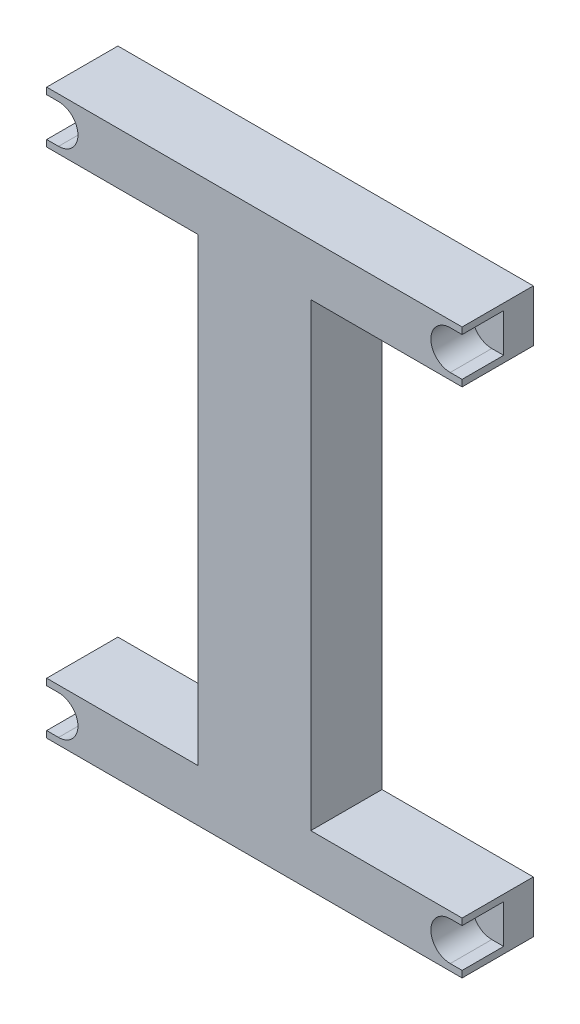
ISO-10303-21;
HEADER;
FILE_DESCRIPTION(('STEP AP214'),'2;1');
FILE_NAME('part.step','',(''),(''),'','','');
FILE_SCHEMA(('AUTOMOTIVE_DESIGN { 1 0 10303 214 1 1 1 1 }'));
ENDSEC;
DATA;
#1=APPLICATION_CONTEXT('core data for automotive mechanical design processes');
#2=APPLICATION_PROTOCOL_DEFINITION('international standard','automotive_design',2000,#1);
#3=PRODUCT_CONTEXT('',#1,'mechanical');
#4=PRODUCT('Part','Part','',(#3));
#5=PRODUCT_RELATED_PRODUCT_CATEGORY('part','',(#4));
#6=PRODUCT_DEFINITION_FORMATION('','',#4);
#7=PRODUCT_DEFINITION_CONTEXT('part definition',#1,'design');
#8=PRODUCT_DEFINITION('design','',#6,#7);
#9=PRODUCT_DEFINITION_SHAPE('','',#8);
#10=(LENGTH_UNIT() NAMED_UNIT(*) SI_UNIT(.MILLI.,.METRE.));
#11=(NAMED_UNIT(*) PLANE_ANGLE_UNIT() SI_UNIT($,.RADIAN.));
#12=(NAMED_UNIT(*) SI_UNIT($,.STERADIAN.) SOLID_ANGLE_UNIT());
#13=UNCERTAINTY_MEASURE_WITH_UNIT(LENGTH_MEASURE(1.E-05),#10,'distance_accuracy_value','');
#14=(GEOMETRIC_REPRESENTATION_CONTEXT(3) GLOBAL_UNCERTAINTY_ASSIGNED_CONTEXT((#13)) GLOBAL_UNIT_ASSIGNED_CONTEXT((#10,
#11,#12)) REPRESENTATION_CONTEXT('',''));
#15=CARTESIAN_POINT('',(0.,0.,0.));
#16=DIRECTION('',(0.,0.,1.));
#17=DIRECTION('',(1.,0.,0.));
#18=AXIS2_PLACEMENT_3D('',#15,#16,#17);
#19=CARTESIAN_POINT('',(0.,0.,24.));
#20=DIRECTION('',(0.,0.,1.));
#21=DIRECTION('',(1.,0.,0.));
#22=AXIS2_PLACEMENT_3D('',#19,#20,#21);
#23=PLANE('',#22);
#24=DIRECTION('',(1.,0.,0.));
#25=VECTOR('',#24,1.);
#26=CARTESIAN_POINT('',(70.,79.7188434375751,24.));
#27=LINE('',#26,#25);
#28=CARTESIAN_POINT('',(66.,79.7188434375752,24.));
#29=VERTEX_POINT('',#28);
#30=CARTESIAN_POINT('',(70.,79.7188434375751,24.));
#31=VERTEX_POINT('',#30);
#32=EDGE_CURVE('E232',#29,#31,#27,.T.);
#33=ORIENTED_EDGE('',*,*,#32,.F.);
#34=CARTESIAN_POINT('',(66.,86.25,24.));
#35=DIRECTION('',(0.,0.,1.));
#36=DIRECTION('',(-1.,0.,0.));
#37=AXIS2_PLACEMENT_3D('',#34,#35,#36);
#38=CIRCLE('',#37,6.53115656242485);
#39=CARTESIAN_POINT('',(66.,92.7811565624249,24.));
#40=VERTEX_POINT('',#39);
#41=EDGE_CURVE('E775',#40,#29,#38,.T.);
#42=ORIENTED_EDGE('',*,*,#41,.F.);
#43=DIRECTION('',(-1.,0.,0.));
#44=VECTOR('',#43,1.);
#45=CARTESIAN_POINT('',(70.,92.781156562425,24.));
#46=LINE('',#45,#44);
#47=CARTESIAN_POINT('',(70.,92.781156562425,24.));
#48=VERTEX_POINT('',#47);
#49=EDGE_CURVE('E265',#48,#40,#46,.T.);
#50=ORIENTED_EDGE('',*,*,#49,.F.);
#51=DIRECTION('',(0.,-1.,0.));
#52=VECTOR('',#51,1.);
#53=CARTESIAN_POINT('',(70.,0.,24.));
#54=LINE('',#53,#52);
#55=CARTESIAN_POINT('',(70.,95.,24.));
#56=VERTEX_POINT('',#55);
#57=EDGE_CURVE('E237',#56,#48,#54,.T.);
#58=ORIENTED_EDGE('',*,*,#57,.F.);
#59=DIRECTION('',(1.,0.,0.));
#60=VECTOR('',#59,1.);
#61=CARTESIAN_POINT('',(0.,95.,24.));
#62=LINE('',#61,#60);
#63=CARTESIAN_POINT('',(-70.,95.,24.));
#64=VERTEX_POINT('',#63);
#65=EDGE_CURVE('E377',#64,#56,#62,.T.);
#66=ORIENTED_EDGE('',*,*,#65,.F.);
#67=DIRECTION('',(0.,-1.,0.));
#68=VECTOR('',#67,1.);
#69=CARTESIAN_POINT('',(-70.,0.,24.));
#70=LINE('',#69,#68);
#71=CARTESIAN_POINT('',(-70.,92.7811565624249,24.));
#72=VERTEX_POINT('',#71);
#73=EDGE_CURVE('E383',#64,#72,#70,.T.);
#74=ORIENTED_EDGE('',*,*,#73,.T.);
#75=DIRECTION('',(-1.,0.,0.));
#76=VECTOR('',#75,1.);
#77=CARTESIAN_POINT('',(-70.,92.7811565624249,24.));
#78=LINE('',#77,#76);
#79=CARTESIAN_POINT('',(-66.,92.7811565624249,24.));
#80=VERTEX_POINT('',#79);
#81=EDGE_CURVE('E248',#80,#72,#78,.T.);
#82=ORIENTED_EDGE('',*,*,#81,.F.);
#83=CARTESIAN_POINT('',(-66.,86.25,24.));
#84=DIRECTION('',(0.,0.,1.));
#85=DIRECTION('',(1.,0.,0.));
#86=AXIS2_PLACEMENT_3D('',#83,#84,#85);
#87=CIRCLE('',#86,6.53115656242487);
#88=CARTESIAN_POINT('',(-66.,79.7188434375752,24.));
#89=VERTEX_POINT('',#88);
#90=EDGE_CURVE('E257',#89,#80,#87,.T.);
#91=ORIENTED_EDGE('',*,*,#90,.F.);
#92=DIRECTION('',(1.,0.,0.));
#93=VECTOR('',#92,1.);
#94=CARTESIAN_POINT('',(-70.,79.718843437575,24.));
#95=LINE('',#94,#93);
#96=CARTESIAN_POINT('',(-70.,79.718843437575,24.));
#97=VERTEX_POINT('',#96);
#98=EDGE_CURVE('E254',#97,#89,#95,.T.);
#99=ORIENTED_EDGE('',*,*,#98,.F.);
#100=CARTESIAN_POINT('',(-70.,77.5,24.));
#101=VERTEX_POINT('',#100);
#102=EDGE_CURVE('E387',#97,#101,#70,.T.);
#103=ORIENTED_EDGE('',*,*,#102,.T.);
#104=DIRECTION('',(1.,0.,0.));
#105=VECTOR('',#104,1.);
#106=CARTESIAN_POINT('',(0.,77.5,24.));
#107=LINE('',#106,#105);
#108=CARTESIAN_POINT('',(-19.,77.5,24.));
#109=VERTEX_POINT('',#108);
#110=EDGE_CURVE('E356',#101,#109,#107,.T.);
#111=ORIENTED_EDGE('',*,*,#110,.T.);
#112=DIRECTION('',(0.,-1.,0.));
#113=VECTOR('',#112,1.);
#114=CARTESIAN_POINT('',(-19.,0.,24.));
#115=LINE('',#114,#113);
#116=CARTESIAN_POINT('',(-19.,-77.5,24.));
#117=VERTEX_POINT('',#116);
#118=EDGE_CURVE('E339',#109,#117,#115,.T.);
#119=ORIENTED_EDGE('',*,*,#118,.T.);
#120=DIRECTION('',(-1.,0.,0.));
#121=VECTOR('',#120,1.);
#122=CARTESIAN_POINT('',(0.,-77.5,24.));
#123=LINE('',#122,#121);
#124=CARTESIAN_POINT('',(-70.,-77.5,24.));
#125=VERTEX_POINT('',#124);
#126=EDGE_CURVE('E349',#117,#125,#123,.T.);
#127=ORIENTED_EDGE('',*,*,#126,.T.);
#128=CARTESIAN_POINT('',(-70.,-79.7188434375751,24.));
#129=VERTEX_POINT('',#128);
#130=EDGE_CURVE('E388',#125,#129,#70,.T.);
#131=ORIENTED_EDGE('',*,*,#130,.T.);
#132=DIRECTION('',(-1.,0.,0.));
#133=VECTOR('',#132,1.);
#134=CARTESIAN_POINT('',(-70.,-79.7188434375751,24.));
#135=LINE('',#134,#133);
#136=CARTESIAN_POINT('',(-66.,-79.7188434375752,24.));
#137=VERTEX_POINT('',#136);
#138=EDGE_CURVE('E275',#137,#129,#135,.T.);
#139=ORIENTED_EDGE('',*,*,#138,.F.);
#140=CARTESIAN_POINT('',(-66.,-86.25,24.));
#141=DIRECTION('',(0.,0.,1.));
#142=DIRECTION('',(-1.,0.,0.));
#143=AXIS2_PLACEMENT_3D('',#140,#141,#142);
#144=CIRCLE('',#143,6.53115656242487);
#145=CARTESIAN_POINT('',(-66.,-92.7811565624249,24.));
#146=VERTEX_POINT('',#145);
#147=EDGE_CURVE('E282',#146,#137,#144,.T.);
#148=ORIENTED_EDGE('',*,*,#147,.F.);
#149=DIRECTION('',(1.,0.,0.));
#150=VECTOR('',#149,1.);
#151=CARTESIAN_POINT('',(-70.,-92.781156562425,24.));
#152=LINE('',#151,#150);
#153=CARTESIAN_POINT('',(-70.,-92.781156562425,24.));
#154=VERTEX_POINT('',#153);
#155=EDGE_CURVE('E279',#154,#146,#152,.T.);
#156=ORIENTED_EDGE('',*,*,#155,.F.);
#157=CARTESIAN_POINT('',(-70.,-95.,24.));
#158=VERTEX_POINT('',#157);
#159=EDGE_CURVE('E382',#154,#158,#70,.T.);
#160=ORIENTED_EDGE('',*,*,#159,.T.);
#161=DIRECTION('',(1.,0.,0.));
#162=VECTOR('',#161,1.);
#163=CARTESIAN_POINT('',(0.,-95.,24.));
#164=LINE('',#163,#162);
#165=CARTESIAN_POINT('',(70.,-95.0000000000001,24.));
#166=VERTEX_POINT('',#165);
#167=EDGE_CURVE('E371',#158,#166,#164,.T.);
#168=ORIENTED_EDGE('',*,*,#167,.T.);
#169=CARTESIAN_POINT('',(70.,-92.781156562425,24.));
#170=VERTEX_POINT('',#169);
#171=EDGE_CURVE('E374',#170,#166,#54,.T.);
#172=ORIENTED_EDGE('',*,*,#171,.F.);
#173=DIRECTION('',(1.,0.,0.));
#174=VECTOR('',#173,1.);
#175=CARTESIAN_POINT('',(70.,-92.781156562425,24.));
#176=LINE('',#175,#174);
#177=CARTESIAN_POINT('',(66.,-92.7811565624249,24.));
#178=VERTEX_POINT('',#177);
#179=EDGE_CURVE('E297',#178,#170,#176,.T.);
#180=ORIENTED_EDGE('',*,*,#179,.F.);
#181=CARTESIAN_POINT('',(66.,-86.25,24.));
#182=DIRECTION('',(0.,0.,1.));
#183=DIRECTION('',(1.,0.,0.));
#184=AXIS2_PLACEMENT_3D('',#181,#182,#183);
#185=CIRCLE('',#184,6.53115656242485);
#186=CARTESIAN_POINT('',(66.,-79.7188434375752,24.));
#187=VERTEX_POINT('',#186);
#188=EDGE_CURVE('E306',#187,#178,#185,.T.);
#189=ORIENTED_EDGE('',*,*,#188,.F.);
#190=DIRECTION('',(-1.,0.,0.));
#191=VECTOR('',#190,1.);
#192=CARTESIAN_POINT('',(70.,-79.7188434375751,24.));
#193=LINE('',#192,#191);
#194=CARTESIAN_POINT('',(70.,-79.7188434375751,24.));
#195=VERTEX_POINT('',#194);
#196=EDGE_CURVE('E303',#195,#187,#193,.T.);
#197=ORIENTED_EDGE('',*,*,#196,.F.);
#198=CARTESIAN_POINT('',(70.,-77.5,24.));
#199=VERTEX_POINT('',#198);
#200=EDGE_CURVE('E379',#199,#195,#54,.T.);
#201=ORIENTED_EDGE('',*,*,#200,.F.);
#202=DIRECTION('',(1.,0.,0.));
#203=VECTOR('',#202,1.);
#204=CARTESIAN_POINT('',(0.,-77.5,24.));
#205=LINE('',#204,#203);
#206=CARTESIAN_POINT('',(19.,-77.5,24.));
#207=VERTEX_POINT('',#206);
#208=EDGE_CURVE('E323',#207,#199,#205,.T.);
#209=ORIENTED_EDGE('',*,*,#208,.F.);
#210=DIRECTION('',(0.,-1.,0.));
#211=VECTOR('',#210,1.);
#212=CARTESIAN_POINT('',(19.,0.,24.));
#213=LINE('',#212,#211);
#214=CARTESIAN_POINT('',(19.,77.5,24.));
#215=VERTEX_POINT('',#214);
#216=EDGE_CURVE('E332',#215,#207,#213,.T.);
#217=ORIENTED_EDGE('',*,*,#216,.F.);
#218=DIRECTION('',(1.,0.,0.));
#219=VECTOR('',#218,1.);
#220=CARTESIAN_POINT('',(0.,77.5,24.));
#221=LINE('',#220,#219);
#222=CARTESIAN_POINT('',(70.,77.5,24.));
#223=VERTEX_POINT('',#222);
#224=EDGE_CURVE('E314',#215,#223,#221,.T.);
#225=ORIENTED_EDGE('',*,*,#224,.T.);
#226=EDGE_CURVE('E378',#31,#223,#54,.T.);
#227=ORIENTED_EDGE('',*,*,#226,.F.);
#228=EDGE_LOOP('',(#33,#42,#50,#58,#66,#74,#82,#91,#99,#103,#111,#119,#127,#131,#139,#148,#156,
#160,#168,#172,#180,#189,#197,#201,#209,#217,#225,#227));
#229=FACE_BOUND('',#228,.T.);
#230=ADVANCED_FACE('F33',(#229),#23,.T.);
#231=CARTESIAN_POINT('',(0.,0.,0.));
#232=DIRECTION('',(0.,0.,1.));
#233=DIRECTION('',(1.,0.,0.));
#234=AXIS2_PLACEMENT_3D('',#231,#232,#233);
#235=PLANE('',#234);
#236=DIRECTION('',(1.,0.,0.));
#237=VECTOR('',#236,1.);
#238=CARTESIAN_POINT('',(0.,77.5,0.));
#239=LINE('',#238,#237);
#240=CARTESIAN_POINT('',(19.,77.5,0.));
#241=VERTEX_POINT('',#240);
#242=CARTESIAN_POINT('',(70.,77.5,0.));
#243=VERTEX_POINT('',#242);
#244=EDGE_CURVE('E320',#241,#243,#239,.T.);
#245=ORIENTED_EDGE('',*,*,#244,.F.);
#246=DIRECTION('',(0.,-1.,0.));
#247=VECTOR('',#246,1.);
#248=CARTESIAN_POINT('',(19.,0.,0.));
#249=LINE('',#248,#247);
#250=CARTESIAN_POINT('',(19.,-77.5,0.));
#251=VERTEX_POINT('',#250);
#252=EDGE_CURVE('E322',#241,#251,#249,.T.);
#253=ORIENTED_EDGE('',*,*,#252,.T.);
#254=DIRECTION('',(1.,0.,0.));
#255=VECTOR('',#254,1.);
#256=CARTESIAN_POINT('',(0.,-77.5,0.));
#257=LINE('',#256,#255);
#258=CARTESIAN_POINT('',(70.,-77.5,0.));
#259=VERTEX_POINT('',#258);
#260=EDGE_CURVE('E326',#251,#259,#257,.T.);
#261=ORIENTED_EDGE('',*,*,#260,.T.);
#262=DIRECTION('',(0.,-1.,0.));
#263=VECTOR('',#262,1.);
#264=CARTESIAN_POINT('',(70.,0.,0.));
#265=LINE('',#264,#263);
#266=CARTESIAN_POINT('',(70.,-95.0000000000001,0.));
#267=VERTEX_POINT('',#266);
#268=EDGE_CURVE('E391',#259,#267,#265,.T.);
#269=ORIENTED_EDGE('',*,*,#268,.T.);
#270=DIRECTION('',(1.,0.,0.));
#271=VECTOR('',#270,1.);
#272=CARTESIAN_POINT('',(0.,-95.,0.));
#273=LINE('',#272,#271);
#274=CARTESIAN_POINT('',(-70.,-95.,0.));
#275=VERTEX_POINT('',#274);
#276=EDGE_CURVE('E364',#275,#267,#273,.T.);
#277=ORIENTED_EDGE('',*,*,#276,.F.);
#278=DIRECTION('',(0.,-1.,0.));
#279=VECTOR('',#278,1.);
#280=CARTESIAN_POINT('',(-70.,0.,0.));
#281=LINE('',#280,#279);
#282=CARTESIAN_POINT('',(-70.,-77.5,0.));
#283=VERTEX_POINT('',#282);
#284=EDGE_CURVE('E398',#283,#275,#281,.T.);
#285=ORIENTED_EDGE('',*,*,#284,.F.);
#286=DIRECTION('',(-1.,0.,0.));
#287=VECTOR('',#286,1.);
#288=CARTESIAN_POINT('',(0.,-77.5,0.));
#289=LINE('',#288,#287);
#290=CARTESIAN_POINT('',(-19.,-77.5,0.));
#291=VERTEX_POINT('',#290);
#292=EDGE_CURVE('E351',#291,#283,#289,.T.);
#293=ORIENTED_EDGE('',*,*,#292,.F.);
#294=DIRECTION('',(0.,-1.,0.));
#295=VECTOR('',#294,1.);
#296=CARTESIAN_POINT('',(-19.,0.,0.));
#297=LINE('',#296,#295);
#298=CARTESIAN_POINT('',(-19.,77.5,0.));
#299=VERTEX_POINT('',#298);
#300=EDGE_CURVE('E346',#299,#291,#297,.T.);
#301=ORIENTED_EDGE('',*,*,#300,.F.);
#302=DIRECTION('',(1.,0.,0.));
#303=VECTOR('',#302,1.);
#304=CARTESIAN_POINT('',(0.,77.5,0.));
#305=LINE('',#304,#303);
#306=CARTESIAN_POINT('',(-70.,77.5,0.));
#307=VERTEX_POINT('',#306);
#308=EDGE_CURVE('E348',#307,#299,#305,.T.);
#309=ORIENTED_EDGE('',*,*,#308,.F.);
#310=CARTESIAN_POINT('',(-70.,95.,0.));
#311=VERTEX_POINT('',#310);
#312=EDGE_CURVE('E375',#311,#307,#281,.T.);
#313=ORIENTED_EDGE('',*,*,#312,.F.);
#314=DIRECTION('',(1.,0.,0.));
#315=VECTOR('',#314,1.);
#316=CARTESIAN_POINT('',(0.,95.,0.));
#317=LINE('',#316,#315);
#318=CARTESIAN_POINT('',(70.,95.,0.));
#319=VERTEX_POINT('',#318);
#320=EDGE_CURVE('E395',#311,#319,#317,.T.);
#321=ORIENTED_EDGE('',*,*,#320,.T.);
#322=EDGE_CURVE('E392',#319,#243,#265,.T.);
#323=ORIENTED_EDGE('',*,*,#322,.T.);
#324=EDGE_LOOP('',(#245,#253,#261,#269,#277,#285,#293,#301,#309,#313,#321,#323));
#325=FACE_BOUND('',#324,.T.);
#326=ADVANCED_FACE('F464',(#325),#235,.F.);
#327=CARTESIAN_POINT('',(70.,0.,24.));
#328=DIRECTION('',(1.,0.,0.));
#329=DIRECTION('',(0.,1.,0.));
#330=AXIS2_PLACEMENT_3D('',#327,#328,#329);
#331=PLANE('',#330);
#332=DIRECTION('',(0.,0.,1.));
#333=VECTOR('',#332,1.);
#334=CARTESIAN_POINT('',(70.,79.7188434375751,10.));
#335=LINE('',#334,#333);
#336=CARTESIAN_POINT('',(70.,79.7188434375751,10.));
#337=VERTEX_POINT('',#336);
#338=EDGE_CURVE('E307',#337,#31,#335,.T.);
#339=ORIENTED_EDGE('',*,*,#338,.T.);
#340=ORIENTED_EDGE('',*,*,#226,.T.);
#341=DIRECTION('',(0.,0.,1.));
#342=VECTOR('',#341,1.);
#343=CARTESIAN_POINT('',(70.,77.5,0.));
#344=LINE('',#343,#342);
#345=EDGE_CURVE('E336',#243,#223,#344,.T.);
#346=ORIENTED_EDGE('',*,*,#345,.F.);
#347=ORIENTED_EDGE('',*,*,#322,.F.);
#348=DIRECTION('',(0.,0.,-1.));
#349=VECTOR('',#348,1.);
#350=CARTESIAN_POINT('',(70.,95.,24.));
#351=LINE('',#350,#349);
#352=EDGE_CURVE('E405',#56,#319,#351,.T.);
#353=ORIENTED_EDGE('',*,*,#352,.F.);
#354=ORIENTED_EDGE('',*,*,#57,.T.);
#355=DIRECTION('',(0.,0.,1.));
#356=VECTOR('',#355,1.);
#357=CARTESIAN_POINT('',(70.,92.781156562425,10.));
#358=LINE('',#357,#356);
#359=CARTESIAN_POINT('',(70.,92.781156562425,10.));
#360=VERTEX_POINT('',#359);
#361=EDGE_CURVE('E227',#360,#48,#358,.T.);
#362=ORIENTED_EDGE('',*,*,#361,.F.);
#363=DIRECTION('',(0.,1.,0.));
#364=VECTOR('',#363,1.);
#365=CARTESIAN_POINT('',(70.,0.,10.));
#366=LINE('',#365,#364);
#367=EDGE_CURVE('E11',#337,#360,#366,.T.);
#368=ORIENTED_EDGE('',*,*,#367,.F.);
#369=EDGE_LOOP('',(#339,#340,#346,#347,#353,#354,#362,#368));
#370=FACE_BOUND('',#369,.T.);
#371=ADVANCED_FACE('F235',(#370),#331,.T.);
#372=CARTESIAN_POINT('',(-70.,0.,24.));
#373=DIRECTION('',(1.,0.,0.));
#374=DIRECTION('',(0.,1.,0.));
#375=AXIS2_PLACEMENT_3D('',#372,#373,#374);
#376=PLANE('',#375);
#377=DIRECTION('',(0.,1.,0.));
#378=VECTOR('',#377,1.);
#379=CARTESIAN_POINT('',(-70.,0.,10.));
#380=LINE('',#379,#378);
#381=CARTESIAN_POINT('',(-70.,-92.781156562425,10.));
#382=VERTEX_POINT('',#381);
#383=CARTESIAN_POINT('',(-70.,-79.7188434375751,10.));
#384=VERTEX_POINT('',#383);
#385=EDGE_CURVE('E41',#382,#384,#380,.T.);
#386=ORIENTED_EDGE('',*,*,#385,.T.);
#387=DIRECTION('',(0.,0.,1.));
#388=VECTOR('',#387,1.);
#389=CARTESIAN_POINT('',(-70.,-79.7188434375751,10.));
#390=LINE('',#389,#388);
#391=EDGE_CURVE('E258',#384,#129,#390,.T.);
#392=ORIENTED_EDGE('',*,*,#391,.T.);
#393=ORIENTED_EDGE('',*,*,#130,.F.);
#394=DIRECTION('',(0.,0.,1.));
#395=VECTOR('',#394,1.);
#396=CARTESIAN_POINT('',(-70.,-77.5,0.));
#397=LINE('',#396,#395);
#398=EDGE_CURVE('E365',#283,#125,#397,.T.);
#399=ORIENTED_EDGE('',*,*,#398,.F.);
#400=ORIENTED_EDGE('',*,*,#284,.T.);
#401=DIRECTION('',(0.,0.,-1.));
#402=VECTOR('',#401,1.);
#403=CARTESIAN_POINT('',(-70.,-95.,24.));
#404=LINE('',#403,#402);
#405=EDGE_CURVE('E386',#158,#275,#404,.T.);
#406=ORIENTED_EDGE('',*,*,#405,.F.);
#407=ORIENTED_EDGE('',*,*,#159,.F.);
#408=DIRECTION('',(0.,0.,1.));
#409=VECTOR('',#408,1.);
#410=CARTESIAN_POINT('',(-70.,-92.781156562425,10.));
#411=LINE('',#410,#409);
#412=EDGE_CURVE('E278',#382,#154,#411,.T.);
#413=ORIENTED_EDGE('',*,*,#412,.F.);
#414=EDGE_LOOP('',(#386,#392,#393,#399,#400,#406,#407,#413));
#415=FACE_BOUND('',#414,.T.);
#416=ADVANCED_FACE('F417',(#415),#376,.F.);
#417=DIRECTION('',(0.,-1.,0.));
#418=VECTOR('',#417,1.);
#419=CARTESIAN_POINT('',(-70.,0.,10.));
#420=LINE('',#419,#418);
#421=CARTESIAN_POINT('',(-70.,92.7811565624249,10.));
#422=VERTEX_POINT('',#421);
#423=CARTESIAN_POINT('',(-70.,79.718843437575,10.));
#424=VERTEX_POINT('',#423);
#425=EDGE_CURVE('E413',#422,#424,#420,.T.);
#426=ORIENTED_EDGE('',*,*,#425,.F.);
#427=DIRECTION('',(0.,0.,1.));
#428=VECTOR('',#427,1.);
#429=CARTESIAN_POINT('',(-70.,92.7811565624249,10.));
#430=LINE('',#429,#428);
#431=EDGE_CURVE('E262',#422,#72,#430,.T.);
#432=ORIENTED_EDGE('',*,*,#431,.T.);
#433=ORIENTED_EDGE('',*,*,#73,.F.);
#434=DIRECTION('',(0.,0.,-1.));
#435=VECTOR('',#434,1.);
#436=CARTESIAN_POINT('',(-70.,95.,24.));
#437=LINE('',#436,#435);
#438=EDGE_CURVE('E403',#64,#311,#437,.T.);
#439=ORIENTED_EDGE('',*,*,#438,.T.);
#440=ORIENTED_EDGE('',*,*,#312,.T.);
#441=DIRECTION('',(0.,0.,1.));
#442=VECTOR('',#441,1.);
#443=CARTESIAN_POINT('',(-70.,77.5,0.));
#444=LINE('',#443,#442);
#445=EDGE_CURVE('E367',#307,#101,#444,.T.);
#446=ORIENTED_EDGE('',*,*,#445,.T.);
#447=ORIENTED_EDGE('',*,*,#102,.F.);
#448=DIRECTION('',(0.,0.,1.));
#449=VECTOR('',#448,1.);
#450=CARTESIAN_POINT('',(-70.,79.718843437575,10.));
#451=LINE('',#450,#449);
#452=EDGE_CURVE('E253',#424,#97,#451,.T.);
#453=ORIENTED_EDGE('',*,*,#452,.F.);
#454=EDGE_LOOP('',(#426,#432,#433,#439,#440,#446,#447,#453));
#455=FACE_BOUND('',#454,.T.);
#456=ADVANCED_FACE('F474',(#455),#376,.F.);
#457=CARTESIAN_POINT('',(0.,-95.,24.));
#458=DIRECTION('',(0.,1.,0.));
#459=DIRECTION('',(-1.,0.,0.));
#460=AXIS2_PLACEMENT_3D('',#457,#458,#459);
#461=PLANE('',#460);
#462=ORIENTED_EDGE('',*,*,#276,.T.);
#463=DIRECTION('',(0.,0.,-1.));
#464=VECTOR('',#463,1.);
#465=CARTESIAN_POINT('',(70.,-95.0000000000001,24.));
#466=LINE('',#465,#464);
#467=EDGE_CURVE('E407',#166,#267,#466,.T.);
#468=ORIENTED_EDGE('',*,*,#467,.F.);
#469=ORIENTED_EDGE('',*,*,#167,.F.);
#470=ORIENTED_EDGE('',*,*,#405,.T.);
#471=EDGE_LOOP('',(#462,#468,#469,#470));
#472=FACE_BOUND('',#471,.T.);
#473=ADVANCED_FACE('F35',(#472),#461,.F.);
#474=DIRECTION('',(0.,0.,1.));
#475=VECTOR('',#474,1.);
#476=CARTESIAN_POINT('',(70.,-92.781156562425,10.));
#477=LINE('',#476,#475);
#478=CARTESIAN_POINT('',(70.,-92.781156562425,10.));
#479=VERTEX_POINT('',#478);
#480=EDGE_CURVE('E311',#479,#170,#477,.T.);
#481=ORIENTED_EDGE('',*,*,#480,.T.);
#482=ORIENTED_EDGE('',*,*,#171,.T.);
#483=ORIENTED_EDGE('',*,*,#467,.T.);
#484=ORIENTED_EDGE('',*,*,#268,.F.);
#485=DIRECTION('',(0.,0.,1.));
#486=VECTOR('',#485,1.);
#487=CARTESIAN_POINT('',(70.,-77.5,0.));
#488=LINE('',#487,#486);
#489=EDGE_CURVE('E340',#259,#199,#488,.T.);
#490=ORIENTED_EDGE('',*,*,#489,.T.);
#491=ORIENTED_EDGE('',*,*,#200,.T.);
#492=DIRECTION('',(0.,0.,1.));
#493=VECTOR('',#492,1.);
#494=CARTESIAN_POINT('',(70.,-79.7188434375751,10.));
#495=LINE('',#494,#493);
#496=CARTESIAN_POINT('',(70.,-79.7188434375751,10.));
#497=VERTEX_POINT('',#496);
#498=EDGE_CURVE('E302',#497,#195,#495,.T.);
#499=ORIENTED_EDGE('',*,*,#498,.F.);
#500=DIRECTION('',(0.,-1.,0.));
#501=VECTOR('',#500,1.);
#502=CARTESIAN_POINT('',(70.,0.,10.));
#503=LINE('',#502,#501);
#504=EDGE_CURVE('E410',#497,#479,#503,.T.);
#505=ORIENTED_EDGE('',*,*,#504,.T.);
#506=EDGE_LOOP('',(#481,#482,#483,#484,#490,#491,#499,#505));
#507=FACE_BOUND('',#506,.T.);
#508=ADVANCED_FACE('F445',(#507),#331,.T.);
#509=CARTESIAN_POINT('',(0.,95.,24.));
#510=DIRECTION('',(0.,1.,0.));
#511=DIRECTION('',(-1.,0.,0.));
#512=AXIS2_PLACEMENT_3D('',#509,#510,#511);
#513=PLANE('',#512);
#514=ORIENTED_EDGE('',*,*,#320,.F.);
#515=ORIENTED_EDGE('',*,*,#438,.F.);
#516=ORIENTED_EDGE('',*,*,#65,.T.);
#517=ORIENTED_EDGE('',*,*,#352,.T.);
#518=EDGE_LOOP('',(#514,#515,#516,#517));
#519=FACE_BOUND('',#518,.T.);
#520=ADVANCED_FACE('F470',(#519),#513,.T.);
#521=CARTESIAN_POINT('',(-19.,0.,0.));
#522=DIRECTION('',(-1.,0.,0.));
#523=DIRECTION('',(0.,-1.,0.));
#524=AXIS2_PLACEMENT_3D('',#521,#522,#523);
#525=PLANE('',#524);
#526=ORIENTED_EDGE('',*,*,#118,.F.);
#527=DIRECTION('',(0.,0.,1.));
#528=VECTOR('',#527,1.);
#529=CARTESIAN_POINT('',(-19.,77.5,0.));
#530=LINE('',#529,#528);
#531=EDGE_CURVE('E353',#299,#109,#530,.T.);
#532=ORIENTED_EDGE('',*,*,#531,.F.);
#533=ORIENTED_EDGE('',*,*,#300,.T.);
#534=DIRECTION('',(0.,0.,1.));
#535=VECTOR('',#534,1.);
#536=CARTESIAN_POINT('',(-19.,-77.5,0.));
#537=LINE('',#536,#535);
#538=EDGE_CURVE('E361',#291,#117,#537,.T.);
#539=ORIENTED_EDGE('',*,*,#538,.T.);
#540=EDGE_LOOP('',(#526,#532,#533,#539));
#541=FACE_BOUND('',#540,.T.);
#542=ADVANCED_FACE('F500',(#541),#525,.T.);
#543=CARTESIAN_POINT('',(0.,-77.5,0.));
#544=DIRECTION('',(0.,1.,0.));
#545=DIRECTION('',(-1.,0.,0.));
#546=AXIS2_PLACEMENT_3D('',#543,#544,#545);
#547=PLANE('',#546);
#548=ORIENTED_EDGE('',*,*,#126,.F.);
#549=ORIENTED_EDGE('',*,*,#538,.F.);
#550=ORIENTED_EDGE('',*,*,#292,.T.);
#551=ORIENTED_EDGE('',*,*,#398,.T.);
#552=EDGE_LOOP('',(#548,#549,#550,#551));
#553=FACE_BOUND('',#552,.T.);
#554=ADVANCED_FACE('F502',(#553),#547,.T.);
#555=CARTESIAN_POINT('',(0.,77.5,0.));
#556=DIRECTION('',(0.,-1.,0.));
#557=DIRECTION('',(0.,0.,-1.));
#558=AXIS2_PLACEMENT_3D('',#555,#556,#557);
#559=PLANE('',#558);
#560=ORIENTED_EDGE('',*,*,#110,.F.);
#561=ORIENTED_EDGE('',*,*,#445,.F.);
#562=ORIENTED_EDGE('',*,*,#308,.T.);
#563=ORIENTED_EDGE('',*,*,#531,.T.);
#564=EDGE_LOOP('',(#560,#561,#562,#563));
#565=FACE_BOUND('',#564,.T.);
#566=ADVANCED_FACE('F493',(#565),#559,.T.);
#567=CARTESIAN_POINT('',(0.,77.5,0.));
#568=DIRECTION('',(0.,-1.,0.));
#569=DIRECTION('',(0.,0.,-1.));
#570=AXIS2_PLACEMENT_3D('',#567,#568,#569);
#571=PLANE('',#570);
#572=ORIENTED_EDGE('',*,*,#224,.F.);
#573=DIRECTION('',(0.,0.,1.));
#574=VECTOR('',#573,1.);
#575=CARTESIAN_POINT('',(19.,77.5,0.));
#576=LINE('',#575,#574);
#577=EDGE_CURVE('E329',#241,#215,#576,.T.);
#578=ORIENTED_EDGE('',*,*,#577,.F.);
#579=ORIENTED_EDGE('',*,*,#244,.T.);
#580=ORIENTED_EDGE('',*,*,#345,.T.);
#581=EDGE_LOOP('',(#572,#578,#579,#580));
#582=FACE_BOUND('',#581,.T.);
#583=ADVANCED_FACE('F454',(#582),#571,.T.);
#584=CARTESIAN_POINT('',(0.,-77.5,0.));
#585=DIRECTION('',(0.,-1.,0.));
#586=DIRECTION('',(0.,0.,-1.));
#587=AXIS2_PLACEMENT_3D('',#584,#585,#586);
#588=PLANE('',#587);
#589=ORIENTED_EDGE('',*,*,#208,.T.);
#590=ORIENTED_EDGE('',*,*,#489,.F.);
#591=ORIENTED_EDGE('',*,*,#260,.F.);
#592=DIRECTION('',(0.,0.,1.));
#593=VECTOR('',#592,1.);
#594=CARTESIAN_POINT('',(19.,-77.5,0.));
#595=LINE('',#594,#593);
#596=EDGE_CURVE('E343',#251,#207,#595,.T.);
#597=ORIENTED_EDGE('',*,*,#596,.T.);
#598=EDGE_LOOP('',(#589,#590,#591,#597));
#599=FACE_BOUND('',#598,.T.);
#600=ADVANCED_FACE('F504',(#599),#588,.F.);
#601=CARTESIAN_POINT('',(19.,0.,0.));
#602=DIRECTION('',(-1.,0.,0.));
#603=DIRECTION('',(0.,-1.,0.));
#604=AXIS2_PLACEMENT_3D('',#601,#602,#603);
#605=PLANE('',#604);
#606=ORIENTED_EDGE('',*,*,#216,.T.);
#607=ORIENTED_EDGE('',*,*,#596,.F.);
#608=ORIENTED_EDGE('',*,*,#252,.F.);
#609=ORIENTED_EDGE('',*,*,#577,.T.);
#610=EDGE_LOOP('',(#606,#607,#608,#609));
#611=FACE_BOUND('',#610,.T.);
#612=ADVANCED_FACE('F460',(#611),#605,.F.);
#613=CARTESIAN_POINT('',(70.,-92.781156562425,10.));
#614=DIRECTION('',(0.,-1.,0.));
#615=DIRECTION('',(1.,0.,0.));
#616=AXIS2_PLACEMENT_3D('',#613,#614,#615);
#617=PLANE('',#616);
#618=ORIENTED_EDGE('',*,*,#179,.T.);
#619=ORIENTED_EDGE('',*,*,#480,.F.);
#620=DIRECTION('',(1.,0.,0.));
#621=VECTOR('',#620,1.);
#622=CARTESIAN_POINT('',(70.,-92.781156562425,10.));
#623=LINE('',#622,#621);
#624=CARTESIAN_POINT('',(66.,-92.7811565624249,10.));
#625=VERTEX_POINT('',#624);
#626=EDGE_CURVE('E300',#625,#479,#623,.T.);
#627=ORIENTED_EDGE('',*,*,#626,.F.);
#628=DIRECTION('',(0.,0.,1.));
#629=VECTOR('',#628,1.);
#630=CARTESIAN_POINT('',(66.,-92.7811565624249,10.));
#631=LINE('',#630,#629);
#632=EDGE_CURVE('E315',#625,#178,#631,.T.);
#633=ORIENTED_EDGE('',*,*,#632,.T.);
#634=EDGE_LOOP('',(#618,#619,#627,#633));
#635=FACE_BOUND('',#634,.T.);
#636=ADVANCED_FACE('F516',(#635),#617,.F.);
#637=CARTESIAN_POINT('',(66.,-86.25,10.));
#638=DIRECTION('',(0.,0.,1.));
#639=DIRECTION('',(1.,0.,0.));
#640=AXIS2_PLACEMENT_3D('',#637,#638,#639);
#641=CYLINDRICAL_SURFACE('',#640,6.53115656242485);
#642=ORIENTED_EDGE('',*,*,#188,.T.);
#643=ORIENTED_EDGE('',*,*,#632,.F.);
#644=CARTESIAN_POINT('',(66.,-86.25,10.));
#645=DIRECTION('',(0.,0.,1.));
#646=DIRECTION('',(1.,0.,0.));
#647=AXIS2_PLACEMENT_3D('',#644,#645,#646);
#648=CIRCLE('',#647,6.53115656242485);
#649=CARTESIAN_POINT('',(66.,-79.7188434375752,10.));
#650=VERTEX_POINT('',#649);
#651=EDGE_CURVE('E296',#650,#625,#648,.T.);
#652=ORIENTED_EDGE('',*,*,#651,.F.);
#653=DIRECTION('',(0.,0.,1.));
#654=VECTOR('',#653,1.);
#655=CARTESIAN_POINT('',(66.,-79.7188434375752,10.));
#656=LINE('',#655,#654);
#657=EDGE_CURVE('E317',#650,#187,#656,.T.);
#658=ORIENTED_EDGE('',*,*,#657,.T.);
#659=EDGE_LOOP('',(#642,#643,#652,#658));
#660=FACE_BOUND('',#659,.T.);
#661=ADVANCED_FACE('F518',(#660),#641,.F.);
#662=CARTESIAN_POINT('',(70.,-79.7188434375751,10.));
#663=DIRECTION('',(0.,1.,0.));
#664=DIRECTION('',(-1.,0.,0.));
#665=AXIS2_PLACEMENT_3D('',#662,#663,#664);
#666=PLANE('',#665);
#667=ORIENTED_EDGE('',*,*,#196,.T.);
#668=ORIENTED_EDGE('',*,*,#657,.F.);
#669=DIRECTION('',(-1.,0.,0.));
#670=VECTOR('',#669,1.);
#671=CARTESIAN_POINT('',(70.,-79.7188434375751,10.));
#672=LINE('',#671,#670);
#673=EDGE_CURVE('E293',#497,#650,#672,.T.);
#674=ORIENTED_EDGE('',*,*,#673,.F.);
#675=ORIENTED_EDGE('',*,*,#498,.T.);
#676=EDGE_LOOP('',(#667,#668,#674,#675));
#677=FACE_BOUND('',#676,.T.);
#678=ADVANCED_FACE('F509',(#677),#666,.F.);
#679=CARTESIAN_POINT('',(70.,-86.25,10.));
#680=DIRECTION('',(0.,0.,1.));
#681=DIRECTION('',(1.,0.,0.));
#682=AXIS2_PLACEMENT_3D('',#679,#680,#681);
#683=PLANE('',#682);
#684=ORIENTED_EDGE('',*,*,#673,.T.);
#685=ORIENTED_EDGE('',*,*,#651,.T.);
#686=ORIENTED_EDGE('',*,*,#626,.T.);
#687=ORIENTED_EDGE('',*,*,#504,.F.);
#688=EDGE_LOOP('',(#684,#685,#686,#687));
#689=FACE_BOUND('',#688,.T.);
#690=ADVANCED_FACE('F513',(#689),#683,.T.);
#691=CARTESIAN_POINT('',(-70.,86.2499999999999,10.));
#692=DIRECTION('',(0.,0.,1.));
#693=DIRECTION('',(1.,0.,0.));
#694=AXIS2_PLACEMENT_3D('',#691,#692,#693);
#695=PLANE('',#694);
#696=ORIENTED_EDGE('',*,*,#425,.T.);
#697=DIRECTION('',(1.,0.,0.));
#698=VECTOR('',#697,1.);
#699=CARTESIAN_POINT('',(-70.,79.718843437575,10.));
#700=LINE('',#699,#698);
#701=CARTESIAN_POINT('',(-66.,79.7188434375752,10.));
#702=VERTEX_POINT('',#701);
#703=EDGE_CURVE('E244',#424,#702,#700,.T.);
#704=ORIENTED_EDGE('',*,*,#703,.T.);
#705=CARTESIAN_POINT('',(-66.,86.25,10.));
#706=DIRECTION('',(0.,0.,1.));
#707=DIRECTION('',(1.,0.,0.));
#708=AXIS2_PLACEMENT_3D('',#705,#706,#707);
#709=CIRCLE('',#708,6.53115656242487);
#710=CARTESIAN_POINT('',(-66.,92.7811565624249,10.));
#711=VERTEX_POINT('',#710);
#712=EDGE_CURVE('E247',#702,#711,#709,.T.);
#713=ORIENTED_EDGE('',*,*,#712,.T.);
#714=DIRECTION('',(-1.,0.,0.));
#715=VECTOR('',#714,1.);
#716=CARTESIAN_POINT('',(-70.,92.7811565624249,10.));
#717=LINE('',#716,#715);
#718=EDGE_CURVE('E251',#711,#422,#717,.T.);
#719=ORIENTED_EDGE('',*,*,#718,.T.);
#720=EDGE_LOOP('',(#696,#704,#713,#719));
#721=FACE_BOUND('',#720,.T.);
#722=ADVANCED_FACE('F669',(#721),#695,.T.);
#723=CARTESIAN_POINT('',(-70.,92.7811565624249,10.));
#724=DIRECTION('',(0.,1.,0.));
#725=DIRECTION('',(0.,0.,1.));
#726=AXIS2_PLACEMENT_3D('',#723,#724,#725);
#727=PLANE('',#726);
#728=ORIENTED_EDGE('',*,*,#81,.T.);
#729=ORIENTED_EDGE('',*,*,#431,.F.);
#730=ORIENTED_EDGE('',*,*,#718,.F.);
#731=DIRECTION('',(0.,0.,1.));
#732=VECTOR('',#731,1.);
#733=CARTESIAN_POINT('',(-66.,92.7811565624249,10.));
#734=LINE('',#733,#732);
#735=EDGE_CURVE('E266',#711,#80,#734,.T.);
#736=ORIENTED_EDGE('',*,*,#735,.T.);
#737=EDGE_LOOP('',(#728,#729,#730,#736));
#738=FACE_BOUND('',#737,.T.);
#739=ADVANCED_FACE('F480',(#738),#727,.F.);
#740=CARTESIAN_POINT('',(-66.,86.25,10.));
#741=DIRECTION('',(0.,0.,1.));
#742=DIRECTION('',(1.,0.,0.));
#743=AXIS2_PLACEMENT_3D('',#740,#741,#742);
#744=CYLINDRICAL_SURFACE('',#743,6.53115656242487);
#745=ORIENTED_EDGE('',*,*,#90,.T.);
#746=ORIENTED_EDGE('',*,*,#735,.F.);
#747=ORIENTED_EDGE('',*,*,#712,.F.);
#748=DIRECTION('',(0.,0.,1.));
#749=VECTOR('',#748,1.);
#750=CARTESIAN_POINT('',(-66.,79.7188434375752,10.));
#751=LINE('',#750,#749);
#752=EDGE_CURVE('E268',#702,#89,#751,.T.);
#753=ORIENTED_EDGE('',*,*,#752,.T.);
#754=EDGE_LOOP('',(#745,#746,#747,#753));
#755=FACE_BOUND('',#754,.T.);
#756=ADVANCED_FACE('F484',(#755),#744,.F.);
#757=CARTESIAN_POINT('',(-70.,79.718843437575,10.));
#758=DIRECTION('',(0.,-1.,0.));
#759=DIRECTION('',(1.,0.,0.));
#760=AXIS2_PLACEMENT_3D('',#757,#758,#759);
#761=PLANE('',#760);
#762=ORIENTED_EDGE('',*,*,#98,.T.);
#763=ORIENTED_EDGE('',*,*,#752,.F.);
#764=ORIENTED_EDGE('',*,*,#703,.F.);
#765=ORIENTED_EDGE('',*,*,#452,.T.);
#766=EDGE_LOOP('',(#762,#763,#764,#765));
#767=FACE_BOUND('',#766,.T.);
#768=ADVANCED_FACE('F487',(#767),#761,.F.);
#769=CARTESIAN_POINT('',(-70.,-86.2500000000001,10.));
#770=DIRECTION('',(0.,0.,-1.));
#771=DIRECTION('',(-1.,0.,0.));
#772=AXIS2_PLACEMENT_3D('',#769,#770,#771);
#773=PLANE('',#772);
#774=DIRECTION('',(1.,0.,0.));
#775=VECTOR('',#774,1.);
#776=CARTESIAN_POINT('',(-70.,-92.781156562425,10.));
#777=LINE('',#776,#775);
#778=CARTESIAN_POINT('',(-66.,-92.7811565624249,10.));
#779=VERTEX_POINT('',#778);
#780=EDGE_CURVE('E271',#382,#779,#777,.T.);
#781=ORIENTED_EDGE('',*,*,#780,.T.);
#782=CARTESIAN_POINT('',(-66.,-86.25,10.));
#783=DIRECTION('',(0.,0.,1.));
#784=DIRECTION('',(-1.,0.,0.));
#785=AXIS2_PLACEMENT_3D('',#782,#783,#784);
#786=CIRCLE('',#785,6.53115656242487);
#787=CARTESIAN_POINT('',(-66.,-79.7188434375752,10.));
#788=VERTEX_POINT('',#787);
#789=EDGE_CURVE('E274',#779,#788,#786,.T.);
#790=ORIENTED_EDGE('',*,*,#789,.T.);
#791=DIRECTION('',(-1.,0.,0.));
#792=VECTOR('',#791,1.);
#793=CARTESIAN_POINT('',(-70.,-79.7188434375751,10.));
#794=LINE('',#793,#792);
#795=EDGE_CURVE('E55',#788,#384,#794,.T.);
#796=ORIENTED_EDGE('',*,*,#795,.T.);
#797=ORIENTED_EDGE('',*,*,#385,.F.);
#798=EDGE_LOOP('',(#781,#790,#796,#797));
#799=FACE_BOUND('',#798,.T.);
#800=ADVANCED_FACE('F422',(#799),#773,.F.);
#801=CARTESIAN_POINT('',(-70.,-79.7188434375751,10.));
#802=DIRECTION('',(0.,1.,0.));
#803=DIRECTION('',(-1.,0.,0.));
#804=AXIS2_PLACEMENT_3D('',#801,#802,#803);
#805=PLANE('',#804);
#806=ORIENTED_EDGE('',*,*,#138,.T.);
#807=ORIENTED_EDGE('',*,*,#391,.F.);
#808=ORIENTED_EDGE('',*,*,#795,.F.);
#809=DIRECTION('',(0.,0.,1.));
#810=VECTOR('',#809,1.);
#811=CARTESIAN_POINT('',(-66.,-79.7188434375752,10.));
#812=LINE('',#811,#810);
#813=EDGE_CURVE('E288',#788,#137,#812,.T.);
#814=ORIENTED_EDGE('',*,*,#813,.T.);
#815=EDGE_LOOP('',(#806,#807,#808,#814));
#816=FACE_BOUND('',#815,.T.);
#817=ADVANCED_FACE('F431',(#816),#805,.F.);
#818=CARTESIAN_POINT('',(-66.,-86.25,10.));
#819=DIRECTION('',(0.,0.,1.));
#820=DIRECTION('',(1.,0.,0.));
#821=AXIS2_PLACEMENT_3D('',#818,#819,#820);
#822=CYLINDRICAL_SURFACE('',#821,6.53115656242487);
#823=ORIENTED_EDGE('',*,*,#147,.T.);
#824=ORIENTED_EDGE('',*,*,#813,.F.);
#825=ORIENTED_EDGE('',*,*,#789,.F.);
#826=DIRECTION('',(0.,0.,1.));
#827=VECTOR('',#826,1.);
#828=CARTESIAN_POINT('',(-66.,-92.7811565624249,10.));
#829=LINE('',#828,#827);
#830=EDGE_CURVE('E290',#779,#146,#829,.T.);
#831=ORIENTED_EDGE('',*,*,#830,.T.);
#832=EDGE_LOOP('',(#823,#824,#825,#831));
#833=FACE_BOUND('',#832,.T.);
#834=ADVANCED_FACE('F429',(#833),#822,.F.);
#835=CARTESIAN_POINT('',(-70.,-92.781156562425,10.));
#836=DIRECTION('',(0.,-1.,0.));
#837=DIRECTION('',(1.,0.,0.));
#838=AXIS2_PLACEMENT_3D('',#835,#836,#837);
#839=PLANE('',#838);
#840=ORIENTED_EDGE('',*,*,#155,.T.);
#841=ORIENTED_EDGE('',*,*,#830,.F.);
#842=ORIENTED_EDGE('',*,*,#780,.F.);
#843=ORIENTED_EDGE('',*,*,#412,.T.);
#844=EDGE_LOOP('',(#840,#841,#842,#843));
#845=FACE_BOUND('',#844,.T.);
#846=ADVANCED_FACE('F424',(#845),#839,.F.);
#847=CARTESIAN_POINT('',(70.,79.7188434375751,10.));
#848=DIRECTION('',(0.,-1.,0.));
#849=DIRECTION('',(1.,0.,0.));
#850=AXIS2_PLACEMENT_3D('',#847,#848,#849);
#851=PLANE('',#850);
#852=ORIENTED_EDGE('',*,*,#32,.T.);
#853=ORIENTED_EDGE('',*,*,#338,.F.);
#854=DIRECTION('',(1.,0.,0.));
#855=VECTOR('',#854,1.);
#856=CARTESIAN_POINT('',(70.,79.7188434375751,10.));
#857=LINE('',#856,#855);
#858=CARTESIAN_POINT('',(66.,79.7188434375752,10.));
#859=VERTEX_POINT('',#858);
#860=EDGE_CURVE('E47',#859,#337,#857,.T.);
#861=ORIENTED_EDGE('',*,*,#860,.F.);
#862=DIRECTION('',(0.,0.,1.));
#863=VECTOR('',#862,1.);
#864=CARTESIAN_POINT('',(66.,79.7188434375752,10.));
#865=LINE('',#864,#863);
#866=EDGE_CURVE('E239',#859,#29,#865,.T.);
#867=ORIENTED_EDGE('',*,*,#866,.T.);
#868=EDGE_LOOP('',(#852,#853,#861,#867));
#869=FACE_BOUND('',#868,.T.);
#870=ADVANCED_FACE('F735',(#869),#851,.F.);
#871=CARTESIAN_POINT('',(66.,86.25,10.));
#872=DIRECTION('',(0.,0.,1.));
#873=DIRECTION('',(1.,0.,0.));
#874=AXIS2_PLACEMENT_3D('',#871,#872,#873);
#875=CYLINDRICAL_SURFACE('',#874,6.53115656242485);
#876=ORIENTED_EDGE('',*,*,#41,.T.);
#877=ORIENTED_EDGE('',*,*,#866,.F.);
#878=CARTESIAN_POINT('',(66.,86.25,10.));
#879=DIRECTION('',(0.,0.,1.));
#880=DIRECTION('',(-1.,0.,0.));
#881=AXIS2_PLACEMENT_3D('',#878,#879,#880);
#882=CIRCLE('',#881,6.53115656242485);
#883=CARTESIAN_POINT('',(66.,92.7811565624249,10.));
#884=VERTEX_POINT('',#883);
#885=EDGE_CURVE('E231',#884,#859,#882,.T.);
#886=ORIENTED_EDGE('',*,*,#885,.F.);
#887=DIRECTION('',(0.,0.,1.));
#888=VECTOR('',#887,1.);
#889=CARTESIAN_POINT('',(66.,92.7811565624249,10.));
#890=LINE('',#889,#888);
#891=EDGE_CURVE('E229',#884,#40,#890,.T.);
#892=ORIENTED_EDGE('',*,*,#891,.T.);
#893=EDGE_LOOP('',(#876,#877,#886,#892));
#894=FACE_BOUND('',#893,.T.);
#895=ADVANCED_FACE('F744',(#894),#875,.F.);
#896=CARTESIAN_POINT('',(70.,92.781156562425,10.));
#897=DIRECTION('',(0.,1.,0.));
#898=DIRECTION('',(-1.,0.,0.));
#899=AXIS2_PLACEMENT_3D('',#896,#897,#898);
#900=PLANE('',#899);
#901=ORIENTED_EDGE('',*,*,#49,.T.);
#902=ORIENTED_EDGE('',*,*,#891,.F.);
#903=DIRECTION('',(-1.,0.,0.));
#904=VECTOR('',#903,1.);
#905=CARTESIAN_POINT('',(70.,92.781156562425,10.));
#906=LINE('',#905,#904);
#907=EDGE_CURVE('E220',#360,#884,#906,.T.);
#908=ORIENTED_EDGE('',*,*,#907,.F.);
#909=ORIENTED_EDGE('',*,*,#361,.T.);
#910=EDGE_LOOP('',(#901,#902,#908,#909));
#911=FACE_BOUND('',#910,.T.);
#912=ADVANCED_FACE('F226',(#911),#900,.F.);
#913=CARTESIAN_POINT('',(70.,86.25,10.));
#914=DIRECTION('',(0.,0.,-1.));
#915=DIRECTION('',(-1.,0.,0.));
#916=AXIS2_PLACEMENT_3D('',#913,#914,#915);
#917=PLANE('',#916);
#918=ORIENTED_EDGE('',*,*,#367,.T.);
#919=ORIENTED_EDGE('',*,*,#907,.T.);
#920=ORIENTED_EDGE('',*,*,#885,.T.);
#921=ORIENTED_EDGE('',*,*,#860,.T.);
#922=EDGE_LOOP('',(#918,#919,#920,#921));
#923=FACE_BOUND('',#922,.T.);
#924=ADVANCED_FACE('F219',(#923),#917,.F.);
#925=CLOSED_SHELL('',(#230,#326,#371,#416,#456,#473,#508,#520,#542,#554,#566,#583,#600,#612,
#636,#661,#678,#690,#722,#739,#756,#768,#800,#817,#834,#846,#870,#895,#912,#924));
#926=MANIFOLD_SOLID_BREP('B2',#925);
#927=ADVANCED_BREP_SHAPE_REPRESENTATION('',(#18,#926),#14);
#928=SHAPE_DEFINITION_REPRESENTATION(#9,#927);
ENDSEC;
END-ISO-10303-21;
